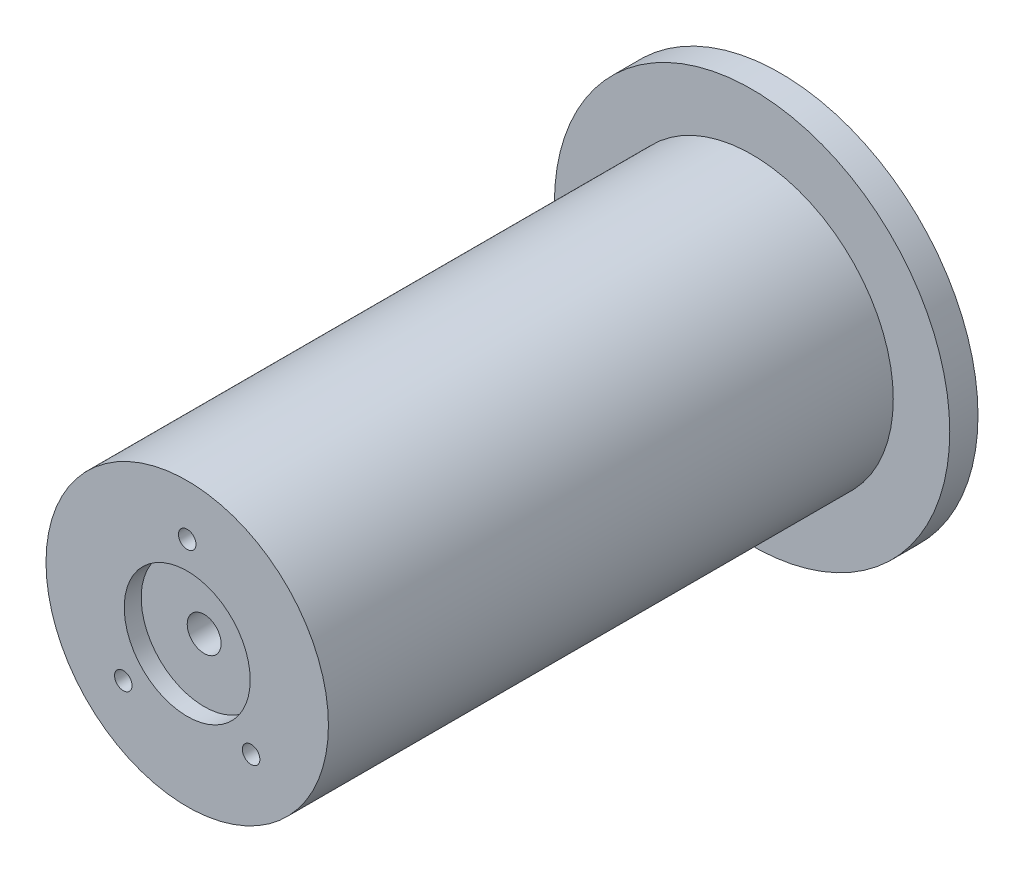
ISO-10303-21;
HEADER;
FILE_DESCRIPTION(('STEP AP214'),'2;1');
FILE_NAME('part.step','',(''),(''),'','','');
FILE_SCHEMA(('AUTOMOTIVE_DESIGN { 1 0 10303 214 1 1 1 1 }'));
ENDSEC;
DATA;
#1=APPLICATION_CONTEXT('core data for automotive mechanical design processes');
#2=APPLICATION_PROTOCOL_DEFINITION('international standard','automotive_design',2000,#1);
#3=PRODUCT_CONTEXT('',#1,'mechanical');
#4=PRODUCT('Part','Part','',(#3));
#5=PRODUCT_RELATED_PRODUCT_CATEGORY('part','',(#4));
#6=PRODUCT_DEFINITION_FORMATION('','',#4);
#7=PRODUCT_DEFINITION_CONTEXT('part definition',#1,'design');
#8=PRODUCT_DEFINITION('design','',#6,#7);
#9=PRODUCT_DEFINITION_SHAPE('','',#8);
#10=(LENGTH_UNIT() NAMED_UNIT(*) SI_UNIT(.MILLI.,.METRE.));
#11=(NAMED_UNIT(*) PLANE_ANGLE_UNIT() SI_UNIT($,.RADIAN.));
#12=(NAMED_UNIT(*) SI_UNIT($,.STERADIAN.) SOLID_ANGLE_UNIT());
#13=UNCERTAINTY_MEASURE_WITH_UNIT(LENGTH_MEASURE(1.E-05),#10,'distance_accuracy_value','');
#14=(GEOMETRIC_REPRESENTATION_CONTEXT(3) GLOBAL_UNCERTAINTY_ASSIGNED_CONTEXT((#13)) GLOBAL_UNIT_ASSIGNED_CONTEXT((#10,
#11,#12)) REPRESENTATION_CONTEXT('',''));
#15=CARTESIAN_POINT('',(0.,0.,0.));
#16=DIRECTION('',(0.,0.,1.));
#17=DIRECTION('',(1.,0.,0.));
#18=AXIS2_PLACEMENT_3D('',#15,#16,#17);
#19=CARTESIAN_POINT('',(0.,0.,100.));
#20=DIRECTION('',(0.,0.,-1.));
#21=DIRECTION('',(-1.,0.,0.));
#22=AXIS2_PLACEMENT_3D('',#19,#20,#21);
#23=CYLINDRICAL_SURFACE('',#22,3.);
#24=CARTESIAN_POINT('',(0.,0.,2.));
#25=DIRECTION('',(0.,0.,-1.));
#26=DIRECTION('',(-1.,0.,0.));
#27=AXIS2_PLACEMENT_3D('',#24,#25,#26);
#28=CIRCLE('',#27,3.);
#29=CARTESIAN_POINT('',(-3.,0.,2.));
#30=VERTEX_POINT('',#29);
#31=EDGE_CURVE('E57',#30,#30,#28,.T.);
#32=ORIENTED_EDGE('',*,*,#31,.T.);
#33=EDGE_LOOP('',(#32));
#34=FACE_BOUND('',#33,.T.);
#35=CARTESIAN_POINT('',(0.,0.,97.));
#36=DIRECTION('',(0.,0.,1.));
#37=DIRECTION('',(1.,0.,0.));
#38=AXIS2_PLACEMENT_3D('',#35,#36,#37);
#39=CIRCLE('',#38,3.);
#40=CARTESIAN_POINT('',(3.,0.,97.));
#41=VERTEX_POINT('',#40);
#42=EDGE_CURVE('E41',#41,#41,#39,.F.);
#43=ORIENTED_EDGE('',*,*,#42,.F.);
#44=EDGE_LOOP('',(#43));
#45=FACE_BOUND('',#44,.T.);
#46=ADVANCED_FACE('F37',(#34,#45),#23,.F.);
#47=CARTESIAN_POINT('',(0.,0.,100.));
#48=DIRECTION('',(0.,0.,-1.));
#49=DIRECTION('',(-1.,0.,0.));
#50=AXIS2_PLACEMENT_3D('',#47,#48,#49);
#51=CYLINDRICAL_SURFACE('',#50,25.);
#52=CARTESIAN_POINT('',(0.,0.,100.));
#53=DIRECTION('',(0.,0.,1.));
#54=DIRECTION('',(1.,0.,0.));
#55=AXIS2_PLACEMENT_3D('',#52,#53,#54);
#56=CIRCLE('',#55,25.);
#57=CARTESIAN_POINT('',(25.,0.,100.));
#58=VERTEX_POINT('',#57);
#59=EDGE_CURVE('E10',#58,#58,#56,.T.);
#60=ORIENTED_EDGE('',*,*,#59,.F.);
#61=EDGE_LOOP('',(#60));
#62=FACE_BOUND('',#61,.T.);
#63=CARTESIAN_POINT('',(0.,0.,0.));
#64=DIRECTION('',(0.,0.,1.));
#65=DIRECTION('',(1.,0.,0.));
#66=AXIS2_PLACEMENT_3D('',#63,#64,#65);
#67=CIRCLE('',#66,25.);
#68=CARTESIAN_POINT('',(25.,0.,0.));
#69=VERTEX_POINT('',#68);
#70=EDGE_CURVE('E46',#69,#69,#67,.T.);
#71=ORIENTED_EDGE('',*,*,#70,.T.);
#72=EDGE_LOOP('',(#71));
#73=FACE_BOUND('',#72,.T.);
#74=ADVANCED_FACE('F39',(#62,#73),#51,.T.);
#75=CARTESIAN_POINT('',(0.,0.,100.));
#76=DIRECTION('',(0.,0.,1.));
#77=DIRECTION('',(1.,0.,0.));
#78=AXIS2_PLACEMENT_3D('',#75,#76,#77);
#79=PLANE('',#78);
#80=CARTESIAN_POINT('',(0.,16.,100.));
#81=DIRECTION('',(0.,0.,1.));
#82=DIRECTION('',(1.,0.,0.));
#83=AXIS2_PLACEMENT_3D('',#80,#81,#82);
#84=CIRCLE('',#83,1.55);
#85=CARTESIAN_POINT('',(1.55,16.,100.));
#86=VERTEX_POINT('',#85);
#87=EDGE_CURVE('E213',#86,#86,#84,.T.);
#88=ORIENTED_EDGE('',*,*,#87,.F.);
#89=EDGE_LOOP('',(#88));
#90=FACE_BOUND('',#89,.T.);
#91=CARTESIAN_POINT('',(-11.3137084989848,-11.3137084989847,100.));
#92=DIRECTION('',(0.,0.,1.));
#93=DIRECTION('',(1.,0.,0.));
#94=AXIS2_PLACEMENT_3D('',#91,#92,#93);
#95=CIRCLE('',#94,1.55);
#96=CARTESIAN_POINT('',(-9.76370849898478,-11.3137084989847,100.));
#97=VERTEX_POINT('',#96);
#98=EDGE_CURVE('E226',#97,#97,#95,.T.);
#99=ORIENTED_EDGE('',*,*,#98,.F.);
#100=EDGE_LOOP('',(#99));
#101=FACE_BOUND('',#100,.T.);
#102=CARTESIAN_POINT('',(11.3137084989848,-11.3137084989847,100.));
#103=DIRECTION('',(0.,0.,1.));
#104=DIRECTION('',(1.,0.,0.));
#105=AXIS2_PLACEMENT_3D('',#102,#103,#104);
#106=CIRCLE('',#105,1.55);
#107=CARTESIAN_POINT('',(12.8637084989848,-11.3137084989847,100.));
#108=VERTEX_POINT('',#107);
#109=EDGE_CURVE('E234',#108,#108,#106,.T.);
#110=ORIENTED_EDGE('',*,*,#109,.F.);
#111=EDGE_LOOP('',(#110));
#112=FACE_BOUND('',#111,.T.);
#113=CARTESIAN_POINT('',(0.,0.,100.));
#114=DIRECTION('',(0.,0.,1.));
#115=DIRECTION('',(1.,0.,0.));
#116=AXIS2_PLACEMENT_3D('',#113,#114,#115);
#117=CIRCLE('',#116,11.15);
#118=CARTESIAN_POINT('',(11.15,0.,100.));
#119=VERTEX_POINT('',#118);
#120=EDGE_CURVE('E79',#119,#119,#117,.T.);
#121=ORIENTED_EDGE('',*,*,#120,.F.);
#122=EDGE_LOOP('',(#121));
#123=FACE_BOUND('',#122,.T.);
#124=ORIENTED_EDGE('',*,*,#59,.T.);
#125=EDGE_LOOP('',(#124));
#126=FACE_BOUND('',#125,.T.);
#127=ADVANCED_FACE('F131',(#90,#101,#112,#123,#126),#79,.T.);
#128=CARTESIAN_POINT('',(0.,0.,-5.));
#129=DIRECTION('',(0.,0.,1.));
#130=DIRECTION('',(1.,0.,0.));
#131=AXIS2_PLACEMENT_3D('',#128,#129,#130);
#132=CYLINDRICAL_SURFACE('',#131,35.);
#133=CARTESIAN_POINT('',(0.,0.,-5.));
#134=DIRECTION('',(0.,0.,-1.));
#135=DIRECTION('',(-1.,0.,0.));
#136=AXIS2_PLACEMENT_3D('',#133,#134,#135);
#137=CIRCLE('',#136,35.);
#138=CARTESIAN_POINT('',(-35.,0.,-5.));
#139=VERTEX_POINT('',#138);
#140=EDGE_CURVE('E52',#139,#139,#137,.T.);
#141=ORIENTED_EDGE('',*,*,#140,.F.);
#142=EDGE_LOOP('',(#141));
#143=FACE_BOUND('',#142,.T.);
#144=CARTESIAN_POINT('',(0.,0.,0.));
#145=DIRECTION('',(0.,0.,-1.));
#146=DIRECTION('',(-1.,0.,0.));
#147=AXIS2_PLACEMENT_3D('',#144,#145,#146);
#148=CIRCLE('',#147,35.);
#149=CARTESIAN_POINT('',(-35.,0.,0.));
#150=VERTEX_POINT('',#149);
#151=EDGE_CURVE('E55',#150,#150,#148,.T.);
#152=ORIENTED_EDGE('',*,*,#151,.T.);
#153=EDGE_LOOP('',(#152));
#154=FACE_BOUND('',#153,.T.);
#155=ADVANCED_FACE('F107',(#143,#154),#132,.T.);
#156=CARTESIAN_POINT('',(0.,0.,-5.));
#157=DIRECTION('',(0.,0.,-1.));
#158=DIRECTION('',(-1.,0.,0.));
#159=AXIS2_PLACEMENT_3D('',#156,#157,#158);
#160=PLANE('',#159);
#161=CARTESIAN_POINT('',(0.,13.,-5.));
#162=DIRECTION('',(0.,0.,-1.));
#163=DIRECTION('',(-1.,0.,0.));
#164=AXIS2_PLACEMENT_3D('',#161,#162,#163);
#165=CIRCLE('',#164,1.5);
#166=CARTESIAN_POINT('',(-1.5,13.,-5.));
#167=VERTEX_POINT('',#166);
#168=EDGE_CURVE('E70',#167,#167,#165,.T.);
#169=ORIENTED_EDGE('',*,*,#168,.F.);
#170=EDGE_LOOP('',(#169));
#171=FACE_BOUND('',#170,.T.);
#172=CARTESIAN_POINT('',(-11.2583302491977,-6.5,-5.));
#173=DIRECTION('',(0.,0.,-1.));
#174=DIRECTION('',(-1.,0.,0.));
#175=AXIS2_PLACEMENT_3D('',#172,#173,#174);
#176=CIRCLE('',#175,1.5);
#177=CARTESIAN_POINT('',(-12.7583302491977,-6.5,-5.));
#178=VERTEX_POINT('',#177);
#179=EDGE_CURVE('E85',#178,#178,#176,.T.);
#180=ORIENTED_EDGE('',*,*,#179,.F.);
#181=EDGE_LOOP('',(#180));
#182=FACE_BOUND('',#181,.T.);
#183=CARTESIAN_POINT('',(11.2583302491977,-6.5,-5.));
#184=DIRECTION('',(0.,0.,-1.));
#185=DIRECTION('',(-1.,0.,0.));
#186=AXIS2_PLACEMENT_3D('',#183,#184,#185);
#187=CIRCLE('',#186,1.5);
#188=CARTESIAN_POINT('',(9.7583302491977,-6.5,-5.));
#189=VERTEX_POINT('',#188);
#190=EDGE_CURVE('E93',#189,#189,#187,.T.);
#191=ORIENTED_EDGE('',*,*,#190,.F.);
#192=EDGE_LOOP('',(#191));
#193=FACE_BOUND('',#192,.T.);
#194=CARTESIAN_POINT('',(0.,0.,-5.));
#195=DIRECTION('',(0.,0.,-1.));
#196=DIRECTION('',(-1.,0.,0.));
#197=AXIS2_PLACEMENT_3D('',#194,#195,#196);
#198=CIRCLE('',#197,9.8);
#199=CARTESIAN_POINT('',(-9.8,0.,-5.));
#200=VERTEX_POINT('',#199);
#201=EDGE_CURVE('E60',#200,#200,#198,.T.);
#202=ORIENTED_EDGE('',*,*,#201,.F.);
#203=EDGE_LOOP('',(#202));
#204=FACE_BOUND('',#203,.T.);
#205=ORIENTED_EDGE('',*,*,#140,.T.);
#206=EDGE_LOOP('',(#205));
#207=FACE_BOUND('',#206,.T.);
#208=ADVANCED_FACE('F112',(#171,#182,#193,#204,#207),#160,.T.);
#209=CARTESIAN_POINT('',(0.,0.,0.));
#210=DIRECTION('',(0.,0.,-1.));
#211=DIRECTION('',(-1.,0.,0.));
#212=AXIS2_PLACEMENT_3D('',#209,#210,#211);
#213=PLANE('',#212);
#214=ORIENTED_EDGE('',*,*,#70,.F.);
#215=EDGE_LOOP('',(#214));
#216=FACE_BOUND('',#215,.T.);
#217=ORIENTED_EDGE('',*,*,#151,.F.);
#218=EDGE_LOOP('',(#217));
#219=FACE_BOUND('',#218,.T.);
#220=ADVANCED_FACE('F109',(#216,#219),#213,.F.);
#221=CARTESIAN_POINT('',(0.,0.,2.));
#222=DIRECTION('',(0.,0.,-1.));
#223=DIRECTION('',(-1.,0.,0.));
#224=AXIS2_PLACEMENT_3D('',#221,#222,#223);
#225=CYLINDRICAL_SURFACE('',#224,9.8);
#226=CARTESIAN_POINT('',(0.,0.,2.));
#227=DIRECTION('',(0.,0.,-1.));
#228=DIRECTION('',(-1.,0.,0.));
#229=AXIS2_PLACEMENT_3D('',#226,#227,#228);
#230=CIRCLE('',#229,9.8);
#231=CARTESIAN_POINT('',(-9.8,0.,2.));
#232=VERTEX_POINT('',#231);
#233=EDGE_CURVE('E67',#232,#232,#230,.T.);
#234=ORIENTED_EDGE('',*,*,#233,.F.);
#235=EDGE_LOOP('',(#234));
#236=FACE_BOUND('',#235,.T.);
#237=ORIENTED_EDGE('',*,*,#201,.T.);
#238=EDGE_LOOP('',(#237));
#239=FACE_BOUND('',#238,.T.);
#240=ADVANCED_FACE('F111',(#236,#239),#225,.F.);
#241=CARTESIAN_POINT('',(0.,0.,2.));
#242=DIRECTION('',(0.,0.,-1.));
#243=DIRECTION('',(-1.,0.,0.));
#244=AXIS2_PLACEMENT_3D('',#241,#242,#243);
#245=PLANE('',#244);
#246=ORIENTED_EDGE('',*,*,#31,.F.);
#247=EDGE_LOOP('',(#246));
#248=FACE_BOUND('',#247,.T.);
#249=ORIENTED_EDGE('',*,*,#233,.T.);
#250=EDGE_LOOP('',(#249));
#251=FACE_BOUND('',#250,.T.);
#252=ADVANCED_FACE('F119',(#248,#251),#245,.T.);
#253=CARTESIAN_POINT('',(11.2583302491977,-6.5,5.));
#254=DIRECTION('',(0.,0.,-1.));
#255=DIRECTION('',(-1.,0.,0.));
#256=AXIS2_PLACEMENT_3D('',#253,#254,#255);
#257=CYLINDRICAL_SURFACE('',#256,1.5);
#258=CARTESIAN_POINT('',(11.2583302491977,-6.5,5.));
#259=DIRECTION('',(0.,0.,-1.));
#260=DIRECTION('',(-1.,0.,0.));
#261=AXIS2_PLACEMENT_3D('',#258,#259,#260);
#262=CIRCLE('',#261,1.5);
#263=CARTESIAN_POINT('',(9.7583302491977,-6.5,5.));
#264=VERTEX_POINT('',#263);
#265=EDGE_CURVE('E89',#264,#264,#262,.T.);
#266=ORIENTED_EDGE('',*,*,#265,.F.);
#267=EDGE_LOOP('',(#266));
#268=FACE_BOUND('',#267,.T.);
#269=ORIENTED_EDGE('',*,*,#190,.T.);
#270=EDGE_LOOP('',(#269));
#271=FACE_BOUND('',#270,.T.);
#272=ADVANCED_FACE('F136',(#268,#271),#257,.F.);
#273=CARTESIAN_POINT('',(11.2583302491977,-6.5,5.));
#274=DIRECTION('',(0.,0.,-1.));
#275=DIRECTION('',(-1.,0.,0.));
#276=AXIS2_PLACEMENT_3D('',#273,#274,#275);
#277=PLANE('',#276);
#278=ORIENTED_EDGE('',*,*,#265,.T.);
#279=EDGE_LOOP('',(#278));
#280=FACE_BOUND('',#279,.T.);
#281=ADVANCED_FACE('F143',(#280),#277,.T.);
#282=CARTESIAN_POINT('',(-11.2583302491977,-6.5,5.));
#283=DIRECTION('',(0.,0.,-1.));
#284=DIRECTION('',(-1.,0.,0.));
#285=AXIS2_PLACEMENT_3D('',#282,#283,#284);
#286=CYLINDRICAL_SURFACE('',#285,1.5);
#287=CARTESIAN_POINT('',(-11.2583302491977,-6.5,5.));
#288=DIRECTION('',(0.,0.,-1.));
#289=DIRECTION('',(-1.,0.,0.));
#290=AXIS2_PLACEMENT_3D('',#287,#288,#289);
#291=CIRCLE('',#290,1.5);
#292=CARTESIAN_POINT('',(-12.7583302491977,-6.5,5.));
#293=VERTEX_POINT('',#292);
#294=EDGE_CURVE('E76',#293,#293,#291,.T.);
#295=ORIENTED_EDGE('',*,*,#294,.F.);
#296=EDGE_LOOP('',(#295));
#297=FACE_BOUND('',#296,.T.);
#298=ORIENTED_EDGE('',*,*,#179,.T.);
#299=EDGE_LOOP('',(#298));
#300=FACE_BOUND('',#299,.T.);
#301=ADVANCED_FACE('F153',(#297,#300),#286,.F.);
#302=CARTESIAN_POINT('',(-11.2583302491977,-6.5,5.));
#303=DIRECTION('',(0.,0.,-1.));
#304=DIRECTION('',(-1.,0.,0.));
#305=AXIS2_PLACEMENT_3D('',#302,#303,#304);
#306=PLANE('',#305);
#307=ORIENTED_EDGE('',*,*,#294,.T.);
#308=EDGE_LOOP('',(#307));
#309=FACE_BOUND('',#308,.T.);
#310=ADVANCED_FACE('F162',(#309),#306,.T.);
#311=CARTESIAN_POINT('',(0.,13.,5.));
#312=DIRECTION('',(0.,0.,-1.));
#313=DIRECTION('',(-1.,0.,0.));
#314=AXIS2_PLACEMENT_3D('',#311,#312,#313);
#315=CYLINDRICAL_SURFACE('',#314,1.5);
#316=CARTESIAN_POINT('',(0.,13.,5.));
#317=DIRECTION('',(0.,0.,-1.));
#318=DIRECTION('',(-1.,0.,0.));
#319=AXIS2_PLACEMENT_3D('',#316,#317,#318);
#320=CIRCLE('',#319,1.5);
#321=CARTESIAN_POINT('',(-1.5,13.,5.));
#322=VERTEX_POINT('',#321);
#323=EDGE_CURVE('E61',#322,#322,#320,.T.);
#324=ORIENTED_EDGE('',*,*,#323,.F.);
#325=EDGE_LOOP('',(#324));
#326=FACE_BOUND('',#325,.T.);
#327=ORIENTED_EDGE('',*,*,#168,.T.);
#328=EDGE_LOOP('',(#327));
#329=FACE_BOUND('',#328,.T.);
#330=ADVANCED_FACE('F168',(#326,#329),#315,.F.);
#331=CARTESIAN_POINT('',(0.,13.,5.));
#332=DIRECTION('',(0.,0.,-1.));
#333=DIRECTION('',(-1.,0.,0.));
#334=AXIS2_PLACEMENT_3D('',#331,#332,#333);
#335=PLANE('',#334);
#336=ORIENTED_EDGE('',*,*,#323,.T.);
#337=EDGE_LOOP('',(#336));
#338=FACE_BOUND('',#337,.T.);
#339=ADVANCED_FACE('F172',(#338),#335,.T.);
#340=CARTESIAN_POINT('',(0.,0.,97.));
#341=DIRECTION('',(0.,0.,1.));
#342=DIRECTION('',(1.,0.,0.));
#343=AXIS2_PLACEMENT_3D('',#340,#341,#342);
#344=PLANE('',#343);
#345=CARTESIAN_POINT('',(0.,0.,97.));
#346=DIRECTION('',(0.,0.,1.));
#347=DIRECTION('',(1.,0.,0.));
#348=AXIS2_PLACEMENT_3D('',#345,#346,#347);
#349=CIRCLE('',#348,11.15);
#350=CARTESIAN_POINT('',(11.15,0.,97.));
#351=VERTEX_POINT('',#350);
#352=EDGE_CURVE('E218',#351,#351,#349,.T.);
#353=ORIENTED_EDGE('',*,*,#352,.T.);
#354=EDGE_LOOP('',(#353));
#355=FACE_BOUND('',#354,.T.);
#356=ORIENTED_EDGE('',*,*,#42,.T.);
#357=EDGE_LOOP('',(#356));
#358=FACE_BOUND('',#357,.T.);
#359=ADVANCED_FACE('F176',(#355,#358),#344,.T.);
#360=CARTESIAN_POINT('',(0.,0.,97.));
#361=DIRECTION('',(0.,0.,1.));
#362=DIRECTION('',(1.,0.,0.));
#363=AXIS2_PLACEMENT_3D('',#360,#361,#362);
#364=CYLINDRICAL_SURFACE('',#363,11.15);
#365=ORIENTED_EDGE('',*,*,#352,.F.);
#366=EDGE_LOOP('',(#365));
#367=FACE_BOUND('',#366,.T.);
#368=ORIENTED_EDGE('',*,*,#120,.T.);
#369=EDGE_LOOP('',(#368));
#370=FACE_BOUND('',#369,.T.);
#371=ADVANCED_FACE('F177',(#367,#370),#364,.F.);
#372=CARTESIAN_POINT('',(11.3137084989848,-11.3137084989847,90.));
#373=DIRECTION('',(0.,0.,1.));
#374=DIRECTION('',(1.,0.,0.));
#375=AXIS2_PLACEMENT_3D('',#372,#373,#374);
#376=CYLINDRICAL_SURFACE('',#375,1.55);
#377=CARTESIAN_POINT('',(11.3137084989848,-11.3137084989847,90.));
#378=DIRECTION('',(0.,0.,1.));
#379=DIRECTION('',(1.,0.,0.));
#380=AXIS2_PLACEMENT_3D('',#377,#378,#379);
#381=CIRCLE('',#380,1.55);
#382=CARTESIAN_POINT('',(12.8637084989848,-11.3137084989847,90.));
#383=VERTEX_POINT('',#382);
#384=EDGE_CURVE('E230',#383,#383,#381,.T.);
#385=ORIENTED_EDGE('',*,*,#384,.F.);
#386=EDGE_LOOP('',(#385));
#387=FACE_BOUND('',#386,.T.);
#388=ORIENTED_EDGE('',*,*,#109,.T.);
#389=EDGE_LOOP('',(#388));
#390=FACE_BOUND('',#389,.T.);
#391=ADVANCED_FACE('F180',(#387,#390),#376,.F.);
#392=CARTESIAN_POINT('',(11.3137084989848,-11.3137084989847,90.));
#393=DIRECTION('',(0.,0.,1.));
#394=DIRECTION('',(1.,0.,0.));
#395=AXIS2_PLACEMENT_3D('',#392,#393,#394);
#396=PLANE('',#395);
#397=ORIENTED_EDGE('',*,*,#384,.T.);
#398=EDGE_LOOP('',(#397));
#399=FACE_BOUND('',#398,.T.);
#400=ADVANCED_FACE('F187',(#399),#396,.T.);
#401=CARTESIAN_POINT('',(-11.3137084989848,-11.3137084989847,90.));
#402=DIRECTION('',(0.,0.,1.));
#403=DIRECTION('',(1.,0.,0.));
#404=AXIS2_PLACEMENT_3D('',#401,#402,#403);
#405=CYLINDRICAL_SURFACE('',#404,1.55);
#406=CARTESIAN_POINT('',(-11.3137084989848,-11.3137084989847,90.));
#407=DIRECTION('',(0.,0.,1.));
#408=DIRECTION('',(1.,0.,0.));
#409=AXIS2_PLACEMENT_3D('',#406,#407,#408);
#410=CIRCLE('',#409,1.55);
#411=CARTESIAN_POINT('',(-9.76370849898478,-11.3137084989847,90.));
#412=VERTEX_POINT('',#411);
#413=EDGE_CURVE('E220',#412,#412,#410,.T.);
#414=ORIENTED_EDGE('',*,*,#413,.F.);
#415=EDGE_LOOP('',(#414));
#416=FACE_BOUND('',#415,.T.);
#417=ORIENTED_EDGE('',*,*,#98,.T.);
#418=EDGE_LOOP('',(#417));
#419=FACE_BOUND('',#418,.T.);
#420=ADVANCED_FACE('F191',(#416,#419),#405,.F.);
#421=CARTESIAN_POINT('',(-11.3137084989848,-11.3137084989847,90.));
#422=DIRECTION('',(0.,0.,1.));
#423=DIRECTION('',(1.,0.,0.));
#424=AXIS2_PLACEMENT_3D('',#421,#422,#423);
#425=PLANE('',#424);
#426=ORIENTED_EDGE('',*,*,#413,.T.);
#427=EDGE_LOOP('',(#426));
#428=FACE_BOUND('',#427,.T.);
#429=ADVANCED_FACE('F195',(#428),#425,.T.);
#430=CARTESIAN_POINT('',(0.,16.,90.));
#431=DIRECTION('',(0.,0.,1.));
#432=DIRECTION('',(1.,0.,0.));
#433=AXIS2_PLACEMENT_3D('',#430,#431,#432);
#434=CYLINDRICAL_SURFACE('',#433,1.55);
#435=CARTESIAN_POINT('',(0.,16.,90.));
#436=DIRECTION('',(0.,0.,1.));
#437=DIRECTION('',(1.,0.,0.));
#438=AXIS2_PLACEMENT_3D('',#435,#436,#437);
#439=CIRCLE('',#438,1.55);
#440=CARTESIAN_POINT('',(1.55,16.,90.));
#441=VERTEX_POINT('',#440);
#442=EDGE_CURVE('E211',#441,#441,#439,.T.);
#443=ORIENTED_EDGE('',*,*,#442,.F.);
#444=EDGE_LOOP('',(#443));
#445=FACE_BOUND('',#444,.T.);
#446=ORIENTED_EDGE('',*,*,#87,.T.);
#447=EDGE_LOOP('',(#446));
#448=FACE_BOUND('',#447,.T.);
#449=ADVANCED_FACE('F199',(#445,#448),#434,.F.);
#450=CARTESIAN_POINT('',(0.,16.,90.));
#451=DIRECTION('',(0.,0.,1.));
#452=DIRECTION('',(1.,0.,0.));
#453=AXIS2_PLACEMENT_3D('',#450,#451,#452);
#454=PLANE('',#453);
#455=ORIENTED_EDGE('',*,*,#442,.T.);
#456=EDGE_LOOP('',(#455));
#457=FACE_BOUND('',#456,.T.);
#458=ADVANCED_FACE('F203',(#457),#454,.T.);
#459=CLOSED_SHELL('',(#46,#74,#127,#155,#208,#220,#240,#252,#272,#281,#301,#310,#330,#339,#359,
#371,#391,#400,#420,#429,#449,#458));
#460=MANIFOLD_SOLID_BREP('B2',#459);
#461=ADVANCED_BREP_SHAPE_REPRESENTATION('',(#18,#460),#14);
#462=SHAPE_DEFINITION_REPRESENTATION(#9,#461);
ENDSEC;
END-ISO-10303-21;
